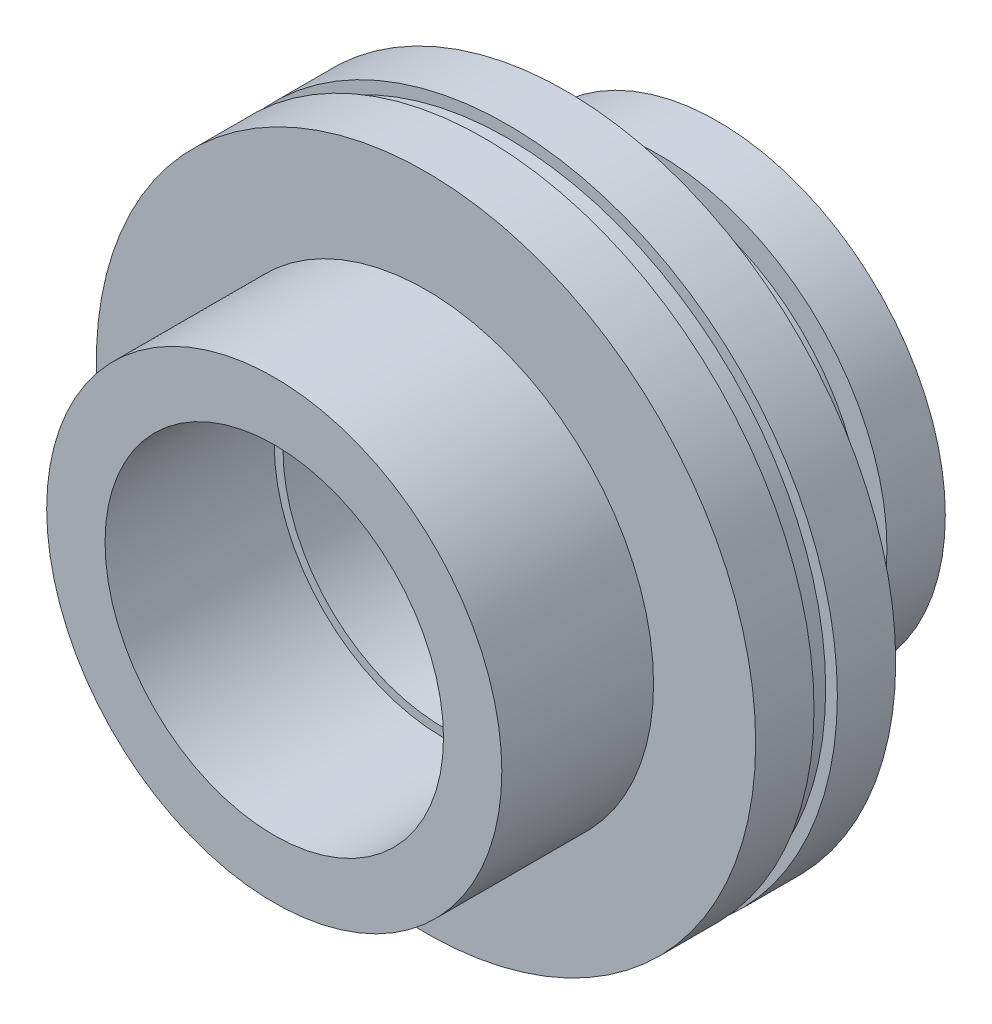
ISO-10303-21;
HEADER;
FILE_DESCRIPTION(('STEP AP214'),'2;1');
FILE_NAME('part.step','',(''),(''),'','','');
FILE_SCHEMA(('AUTOMOTIVE_DESIGN { 1 0 10303 214 1 1 1 1 }'));
ENDSEC;
DATA;
#1=APPLICATION_CONTEXT('core data for automotive mechanical design processes');
#2=APPLICATION_PROTOCOL_DEFINITION('international standard','automotive_design',2000,#1);
#3=PRODUCT_CONTEXT('',#1,'mechanical');
#4=PRODUCT('Part','Part','',(#3));
#5=PRODUCT_RELATED_PRODUCT_CATEGORY('part','',(#4));
#6=PRODUCT_DEFINITION_FORMATION('','',#4);
#7=PRODUCT_DEFINITION_CONTEXT('part definition',#1,'design');
#8=PRODUCT_DEFINITION('design','',#6,#7);
#9=PRODUCT_DEFINITION_SHAPE('','',#8);
#10=(LENGTH_UNIT() NAMED_UNIT(*) SI_UNIT(.MILLI.,.METRE.));
#11=(NAMED_UNIT(*) PLANE_ANGLE_UNIT() SI_UNIT($,.RADIAN.));
#12=(NAMED_UNIT(*) SI_UNIT($,.STERADIAN.) SOLID_ANGLE_UNIT());
#13=UNCERTAINTY_MEASURE_WITH_UNIT(LENGTH_MEASURE(1.E-05),#10,'distance_accuracy_value','');
#14=(GEOMETRIC_REPRESENTATION_CONTEXT(3) GLOBAL_UNCERTAINTY_ASSIGNED_CONTEXT((#13)) GLOBAL_UNIT_ASSIGNED_CONTEXT((#10,
#11,#12)) REPRESENTATION_CONTEXT('',''));
#15=CARTESIAN_POINT('',(0.,0.,0.));
#16=DIRECTION('',(0.,0.,1.));
#17=DIRECTION('',(1.,0.,0.));
#18=AXIS2_PLACEMENT_3D('',#15,#16,#17);
#19=CARTESIAN_POINT('',(0.,0.,-42.));
#20=DIRECTION('',(0.,0.,1.));
#21=DIRECTION('',(1.,0.,0.));
#22=AXIS2_PLACEMENT_3D('',#19,#20,#21);
#23=CYLINDRICAL_SURFACE('',#22,27.5);
#24=CARTESIAN_POINT('',(0.,0.,9.));
#25=DIRECTION('',(0.,0.,1.));
#26=DIRECTION('',(1.,0.,0.));
#27=AXIS2_PLACEMENT_3D('',#24,#25,#26);
#28=CIRCLE('',#27,27.5);
#29=CARTESIAN_POINT('',(27.5,0.,9.));
#30=VERTEX_POINT('',#29);
#31=EDGE_CURVE('E55',#30,#30,#28,.F.);
#32=ORIENTED_EDGE('',*,*,#31,.F.);
#33=EDGE_LOOP('',(#32));
#34=FACE_BOUND('',#33,.T.);
#35=CARTESIAN_POINT('',(0.,0.,-9.));
#36=DIRECTION('',(0.,0.,-1.));
#37=DIRECTION('',(-1.,0.,0.));
#38=AXIS2_PLACEMENT_3D('',#35,#36,#37);
#39=CIRCLE('',#38,27.5);
#40=CARTESIAN_POINT('',(-27.5,0.,-9.));
#41=VERTEX_POINT('',#40);
#42=EDGE_CURVE('E34',#41,#41,#39,.F.);
#43=ORIENTED_EDGE('',*,*,#42,.F.);
#44=EDGE_LOOP('',(#43));
#45=FACE_BOUND('',#44,.T.);
#46=ADVANCED_FACE('F30',(#34,#45),#23,.F.);
#47=CARTESIAN_POINT('',(0.,0.,38.));
#48=DIRECTION('',(0.,0.,1.));
#49=DIRECTION('',(-1.,0.,0.));
#50=AXIS2_PLACEMENT_3D('',#47,#48,#49);
#51=PLANE('',#50);
#52=CARTESIAN_POINT('',(0.,0.,38.));
#53=DIRECTION('',(0.,0.,-1.));
#54=DIRECTION('',(-1.,0.,0.));
#55=AXIS2_PLACEMENT_3D('',#52,#53,#54);
#56=CIRCLE('',#55,39.);
#57=CARTESIAN_POINT('',(-39.,0.,38.));
#58=VERTEX_POINT('',#57);
#59=EDGE_CURVE('E54',#58,#58,#56,.T.);
#60=ORIENTED_EDGE('',*,*,#59,.F.);
#61=EDGE_LOOP('',(#60));
#62=FACE_BOUND('',#61,.T.);
#63=CARTESIAN_POINT('',(0.,0.,38.));
#64=DIRECTION('',(0.,0.,1.));
#65=DIRECTION('',(1.,0.,0.));
#66=AXIS2_PLACEMENT_3D('',#63,#64,#65);
#67=CIRCLE('',#66,29.);
#68=CARTESIAN_POINT('',(29.,0.,38.));
#69=VERTEX_POINT('',#68);
#70=EDGE_CURVE('E58',#69,#69,#67,.F.);
#71=ORIENTED_EDGE('',*,*,#70,.T.);
#72=EDGE_LOOP('',(#71));
#73=FACE_BOUND('',#72,.T.);
#74=ADVANCED_FACE('F120',(#62,#73),#51,.T.);
#75=CARTESIAN_POINT('',(0.,0.,-38.));
#76=DIRECTION('',(0.,0.,1.));
#77=DIRECTION('',(1.,0.,0.));
#78=AXIS2_PLACEMENT_3D('',#75,#76,#77);
#79=CYLINDRICAL_SURFACE('',#78,39.);
#80=CARTESIAN_POINT('',(0.,0.,-12.));
#81=DIRECTION('',(0.,0.,1.));
#82=DIRECTION('',(1.,0.,0.));
#83=AXIS2_PLACEMENT_3D('',#80,#81,#82);
#84=CIRCLE('',#83,39.);
#85=CARTESIAN_POINT('',(39.,0.,-12.));
#86=VERTEX_POINT('',#85);
#87=EDGE_CURVE('E38',#86,#86,#84,.F.);
#88=ORIENTED_EDGE('',*,*,#87,.T.);
#89=EDGE_LOOP('',(#88));
#90=FACE_BOUND('',#89,.T.);
#91=CARTESIAN_POINT('',(0.,0.,-22.));
#92=DIRECTION('',(0.,0.,-1.));
#93=DIRECTION('',(-1.,0.,0.));
#94=AXIS2_PLACEMENT_3D('',#91,#92,#93);
#95=CIRCLE('',#94,39.);
#96=CARTESIAN_POINT('',(-39.,0.,-22.));
#97=VERTEX_POINT('',#96);
#98=EDGE_CURVE('E47',#97,#97,#95,.T.);
#99=ORIENTED_EDGE('',*,*,#98,.F.);
#100=EDGE_LOOP('',(#99));
#101=FACE_BOUND('',#100,.T.);
#102=ADVANCED_FACE('F126',(#90,#101),#79,.T.);
#103=CARTESIAN_POINT('',(0.,0.,-12.));
#104=DIRECTION('',(0.,0.,1.));
#105=DIRECTION('',(1.,0.,0.));
#106=AXIS2_PLACEMENT_3D('',#103,#104,#105);
#107=PLANE('',#106);
#108=CARTESIAN_POINT('',(0.,0.,-12.));
#109=DIRECTION('',(0.,0.,1.));
#110=DIRECTION('',(1.,0.,0.));
#111=AXIS2_PLACEMENT_3D('',#108,#109,#110);
#112=CIRCLE('',#111,56.5);
#113=CARTESIAN_POINT('',(56.5,0.,-12.));
#114=VERTEX_POINT('',#113);
#115=EDGE_CURVE('E43',#114,#114,#112,.T.);
#116=ORIENTED_EDGE('',*,*,#115,.F.);
#117=EDGE_LOOP('',(#116));
#118=FACE_BOUND('',#117,.T.);
#119=ORIENTED_EDGE('',*,*,#87,.F.);
#120=EDGE_LOOP('',(#119));
#121=FACE_BOUND('',#120,.T.);
#122=ADVANCED_FACE('F107',(#118,#121),#107,.F.);
#123=CARTESIAN_POINT('',(0.,0.,-12.));
#124=DIRECTION('',(0.,0.,1.));
#125=DIRECTION('',(1.,0.,0.));
#126=AXIS2_PLACEMENT_3D('',#123,#124,#125);
#127=CYLINDRICAL_SURFACE('',#126,56.5);
#128=CARTESIAN_POINT('',(0.,0.,2.));
#129=DIRECTION('',(0.,0.,1.));
#130=DIRECTION('',(1.,0.,0.));
#131=AXIS2_PLACEMENT_3D('',#128,#129,#130);
#132=CIRCLE('',#131,56.5);
#133=CARTESIAN_POINT('',(56.5,0.,2.));
#134=VERTEX_POINT('',#133);
#135=EDGE_CURVE('E94',#134,#134,#132,.F.);
#136=ORIENTED_EDGE('',*,*,#135,.F.);
#137=EDGE_LOOP('',(#136));
#138=FACE_BOUND('',#137,.T.);
#139=CARTESIAN_POINT('',(0.,0.,12.));
#140=DIRECTION('',(0.,0.,1.));
#141=DIRECTION('',(1.,0.,0.));
#142=AXIS2_PLACEMENT_3D('',#139,#140,#141);
#143=CIRCLE('',#142,56.5);
#144=CARTESIAN_POINT('',(56.5,0.,12.));
#145=VERTEX_POINT('',#144);
#146=EDGE_CURVE('E91',#145,#145,#143,.T.);
#147=ORIENTED_EDGE('',*,*,#146,.F.);
#148=EDGE_LOOP('',(#147));
#149=FACE_BOUND('',#148,.T.);
#150=ADVANCED_FACE('F32',(#138,#149),#127,.T.);
#151=CARTESIAN_POINT('',(0.,0.,12.));
#152=DIRECTION('',(0.,0.,1.));
#153=DIRECTION('',(1.,0.,0.));
#154=AXIS2_PLACEMENT_3D('',#151,#152,#153);
#155=PLANE('',#154);
#156=CARTESIAN_POINT('',(0.,0.,12.));
#157=DIRECTION('',(0.,0.,1.));
#158=DIRECTION('',(1.,0.,0.));
#159=AXIS2_PLACEMENT_3D('',#156,#157,#158);
#160=CIRCLE('',#159,39.);
#161=CARTESIAN_POINT('',(39.,0.,12.));
#162=VERTEX_POINT('',#161);
#163=EDGE_CURVE('E10',#162,#162,#160,.T.);
#164=ORIENTED_EDGE('',*,*,#163,.F.);
#165=EDGE_LOOP('',(#164));
#166=FACE_BOUND('',#165,.T.);
#167=ORIENTED_EDGE('',*,*,#146,.T.);
#168=EDGE_LOOP('',(#167));
#169=FACE_BOUND('',#168,.T.);
#170=ADVANCED_FACE('F106',(#166,#169),#155,.T.);
#171=CARTESIAN_POINT('',(0.,0.,2.));
#172=DIRECTION('',(0.,0.,1.));
#173=DIRECTION('',(1.,0.,0.));
#174=AXIS2_PLACEMENT_3D('',#171,#172,#173);
#175=PLANE('',#174);
#176=ORIENTED_EDGE('',*,*,#135,.T.);
#177=EDGE_LOOP('',(#176));
#178=FACE_BOUND('',#177,.T.);
#179=CARTESIAN_POINT('',(0.,0.,2.));
#180=DIRECTION('',(0.,0.,1.));
#181=DIRECTION('',(1.,0.,0.));
#182=AXIS2_PLACEMENT_3D('',#179,#180,#181);
#183=CIRCLE('',#182,54.5);
#184=CARTESIAN_POINT('',(54.5,0.,2.));
#185=VERTEX_POINT('',#184);
#186=EDGE_CURVE('E87',#185,#185,#183,.T.);
#187=ORIENTED_EDGE('',*,*,#186,.T.);
#188=EDGE_LOOP('',(#187));
#189=FACE_BOUND('',#188,.T.);
#190=ADVANCED_FACE('F101',(#178,#189),#175,.F.);
#191=CARTESIAN_POINT('',(0.,0.,2.));
#192=DIRECTION('',(0.,0.,-1.));
#193=DIRECTION('',(-1.,0.,0.));
#194=AXIS2_PLACEMENT_3D('',#191,#192,#193);
#195=CYLINDRICAL_SURFACE('',#194,54.5);
#196=ORIENTED_EDGE('',*,*,#186,.F.);
#197=EDGE_LOOP('',(#196));
#198=FACE_BOUND('',#197,.T.);
#199=CARTESIAN_POINT('',(0.,0.,-2.));
#200=DIRECTION('',(0.,0.,1.));
#201=DIRECTION('',(1.,0.,0.));
#202=AXIS2_PLACEMENT_3D('',#199,#200,#201);
#203=CIRCLE('',#202,54.5);
#204=CARTESIAN_POINT('',(54.5,0.,-2.));
#205=VERTEX_POINT('',#204);
#206=EDGE_CURVE('E84',#205,#205,#203,.T.);
#207=ORIENTED_EDGE('',*,*,#206,.T.);
#208=EDGE_LOOP('',(#207));
#209=FACE_BOUND('',#208,.T.);
#210=ADVANCED_FACE('F117',(#198,#209),#195,.T.);
#211=CARTESIAN_POINT('',(0.,0.,-2.));
#212=DIRECTION('',(0.,0.,1.));
#213=DIRECTION('',(1.,0.,0.));
#214=AXIS2_PLACEMENT_3D('',#211,#212,#213);
#215=PLANE('',#214);
#216=CARTESIAN_POINT('',(0.,0.,-2.));
#217=DIRECTION('',(0.,0.,1.));
#218=DIRECTION('',(1.,0.,0.));
#219=AXIS2_PLACEMENT_3D('',#216,#217,#218);
#220=CIRCLE('',#219,56.5);
#221=CARTESIAN_POINT('',(56.5,0.,-2.));
#222=VERTEX_POINT('',#221);
#223=EDGE_CURVE('E90',#222,#222,#220,.F.);
#224=ORIENTED_EDGE('',*,*,#223,.F.);
#225=EDGE_LOOP('',(#224));
#226=FACE_BOUND('',#225,.T.);
#227=ORIENTED_EDGE('',*,*,#206,.F.);
#228=EDGE_LOOP('',(#227));
#229=FACE_BOUND('',#228,.T.);
#230=ADVANCED_FACE('F160',(#226,#229),#215,.T.);
#231=ORIENTED_EDGE('',*,*,#115,.T.);
#232=EDGE_LOOP('',(#231));
#233=FACE_BOUND('',#232,.T.);
#234=ORIENTED_EDGE('',*,*,#223,.T.);
#235=EDGE_LOOP('',(#234));
#236=FACE_BOUND('',#235,.T.);
#237=ADVANCED_FACE('F108',(#233,#236),#127,.T.);
#238=CARTESIAN_POINT('',(0.,0.,38.));
#239=DIRECTION('',(0.,0.,-1.));
#240=DIRECTION('',(-1.,0.,0.));
#241=AXIS2_PLACEMENT_3D('',#238,#239,#240);
#242=CYLINDRICAL_SURFACE('',#241,39.);
#243=ORIENTED_EDGE('',*,*,#59,.T.);
#244=EDGE_LOOP('',(#243));
#245=FACE_BOUND('',#244,.T.);
#246=ORIENTED_EDGE('',*,*,#163,.T.);
#247=EDGE_LOOP('',(#246));
#248=FACE_BOUND('',#247,.T.);
#249=ADVANCED_FACE('F146',(#245,#248),#242,.T.);
#250=CARTESIAN_POINT('',(0.,0.,-28.));
#251=DIRECTION('',(0.,0.,-1.));
#252=DIRECTION('',(-1.,0.,0.));
#253=AXIS2_PLACEMENT_3D('',#250,#251,#252);
#254=PLANE('',#253);
#255=CARTESIAN_POINT('',(0.,0.,-28.));
#256=DIRECTION('',(0.,0.,-1.));
#257=DIRECTION('',(-1.,0.,0.));
#258=AXIS2_PLACEMENT_3D('',#255,#256,#257);
#259=CIRCLE('',#258,35.);
#260=CARTESIAN_POINT('',(-35.,0.,-28.));
#261=VERTEX_POINT('',#260);
#262=EDGE_CURVE('E51',#261,#261,#259,.T.);
#263=ORIENTED_EDGE('',*,*,#262,.T.);
#264=EDGE_LOOP('',(#263));
#265=FACE_BOUND('',#264,.T.);
#266=CARTESIAN_POINT('',(0.,0.,-28.));
#267=DIRECTION('',(0.,0.,-1.));
#268=DIRECTION('',(-1.,0.,0.));
#269=AXIS2_PLACEMENT_3D('',#266,#267,#268);
#270=CIRCLE('',#269,39.);
#271=CARTESIAN_POINT('',(-39.,0.,-28.));
#272=VERTEX_POINT('',#271);
#273=EDGE_CURVE('E50',#272,#272,#270,.T.);
#274=ORIENTED_EDGE('',*,*,#273,.F.);
#275=EDGE_LOOP('',(#274));
#276=FACE_BOUND('',#275,.T.);
#277=ADVANCED_FACE('F139',(#265,#276),#254,.F.);
#278=CARTESIAN_POINT('',(0.,0.,-22.));
#279=DIRECTION('',(0.,0.,-1.));
#280=DIRECTION('',(-1.,0.,0.));
#281=AXIS2_PLACEMENT_3D('',#278,#279,#280);
#282=PLANE('',#281);
#283=CARTESIAN_POINT('',(0.,0.,-22.));
#284=DIRECTION('',(0.,0.,-1.));
#285=DIRECTION('',(-1.,0.,0.));
#286=AXIS2_PLACEMENT_3D('',#283,#284,#285);
#287=CIRCLE('',#286,35.);
#288=CARTESIAN_POINT('',(-35.,0.,-22.));
#289=VERTEX_POINT('',#288);
#290=EDGE_CURVE('E61',#289,#289,#287,.T.);
#291=ORIENTED_EDGE('',*,*,#290,.F.);
#292=EDGE_LOOP('',(#291));
#293=FACE_BOUND('',#292,.T.);
#294=ORIENTED_EDGE('',*,*,#98,.T.);
#295=EDGE_LOOP('',(#294));
#296=FACE_BOUND('',#295,.T.);
#297=ADVANCED_FACE('F135',(#293,#296),#282,.T.);
#298=CARTESIAN_POINT('',(0.,0.,-28.));
#299=DIRECTION('',(0.,0.,1.));
#300=DIRECTION('',(1.,0.,0.));
#301=AXIS2_PLACEMENT_3D('',#298,#299,#300);
#302=CYLINDRICAL_SURFACE('',#301,35.);
#303=ORIENTED_EDGE('',*,*,#262,.F.);
#304=EDGE_LOOP('',(#303));
#305=FACE_BOUND('',#304,.T.);
#306=ORIENTED_EDGE('',*,*,#290,.T.);
#307=EDGE_LOOP('',(#306));
#308=FACE_BOUND('',#307,.T.);
#309=ADVANCED_FACE('F138',(#305,#308),#302,.T.);
#310=CARTESIAN_POINT('',(0.,0.,-38.));
#311=DIRECTION('',(0.,0.,-1.));
#312=DIRECTION('',(-1.,0.,0.));
#313=AXIS2_PLACEMENT_3D('',#310,#311,#312);
#314=PLANE('',#313);
#315=CARTESIAN_POINT('',(0.,0.,-38.));
#316=DIRECTION('',(0.,0.,-1.));
#317=DIRECTION('',(-1.,0.,0.));
#318=AXIS2_PLACEMENT_3D('',#315,#316,#317);
#319=CIRCLE('',#318,29.);
#320=CARTESIAN_POINT('',(-29.,0.,-38.));
#321=VERTEX_POINT('',#320);
#322=EDGE_CURVE('E62',#321,#321,#319,.T.);
#323=ORIENTED_EDGE('',*,*,#322,.F.);
#324=EDGE_LOOP('',(#323));
#325=FACE_BOUND('',#324,.T.);
#326=CARTESIAN_POINT('',(0.,0.,-38.));
#327=DIRECTION('',(0.,0.,-1.));
#328=DIRECTION('',(-1.,0.,0.));
#329=AXIS2_PLACEMENT_3D('',#326,#327,#328);
#330=CIRCLE('',#329,39.);
#331=CARTESIAN_POINT('',(-39.,0.,-38.));
#332=VERTEX_POINT('',#331);
#333=EDGE_CURVE('E81',#332,#332,#330,.T.);
#334=ORIENTED_EDGE('',*,*,#333,.T.);
#335=EDGE_LOOP('',(#334));
#336=FACE_BOUND('',#335,.T.);
#337=ADVANCED_FACE('F143',(#325,#336),#314,.T.);
#338=ORIENTED_EDGE('',*,*,#273,.T.);
#339=EDGE_LOOP('',(#338));
#340=FACE_BOUND('',#339,.T.);
#341=ORIENTED_EDGE('',*,*,#333,.F.);
#342=EDGE_LOOP('',(#341));
#343=FACE_BOUND('',#342,.T.);
#344=ADVANCED_FACE('F154',(#340,#343),#79,.T.);
#345=CARTESIAN_POINT('',(0.,0.,9.));
#346=DIRECTION('',(0.,0.,1.));
#347=DIRECTION('',(1.,0.,0.));
#348=AXIS2_PLACEMENT_3D('',#345,#346,#347);
#349=PLANE('',#348);
#350=CARTESIAN_POINT('',(0.,0.,9.));
#351=DIRECTION('',(0.,0.,1.));
#352=DIRECTION('',(1.,0.,0.));
#353=AXIS2_PLACEMENT_3D('',#350,#351,#352);
#354=CIRCLE('',#353,29.);
#355=CARTESIAN_POINT('',(29.,0.,9.));
#356=VERTEX_POINT('',#355);
#357=EDGE_CURVE('E59',#356,#356,#354,.T.);
#358=ORIENTED_EDGE('',*,*,#357,.T.);
#359=EDGE_LOOP('',(#358));
#360=FACE_BOUND('',#359,.T.);
#361=ORIENTED_EDGE('',*,*,#31,.T.);
#362=EDGE_LOOP('',(#361));
#363=FACE_BOUND('',#362,.T.);
#364=ADVANCED_FACE('F158',(#360,#363),#349,.T.);
#365=CARTESIAN_POINT('',(0.,0.,59.));
#366=DIRECTION('',(0.,0.,-1.));
#367=DIRECTION('',(-1.,0.,0.));
#368=AXIS2_PLACEMENT_3D('',#365,#366,#367);
#369=CYLINDRICAL_SURFACE('',#368,29.);
#370=ORIENTED_EDGE('',*,*,#70,.F.);
#371=EDGE_LOOP('',(#370));
#372=FACE_BOUND('',#371,.T.);
#373=ORIENTED_EDGE('',*,*,#357,.F.);
#374=EDGE_LOOP('',(#373));
#375=FACE_BOUND('',#374,.T.);
#376=ADVANCED_FACE('F133',(#372,#375),#369,.F.);
#377=CARTESIAN_POINT('',(0.,0.,-9.));
#378=DIRECTION('',(0.,0.,-1.));
#379=DIRECTION('',(1.,0.,0.));
#380=AXIS2_PLACEMENT_3D('',#377,#378,#379);
#381=PLANE('',#380);
#382=CARTESIAN_POINT('',(0.,0.,-9.));
#383=DIRECTION('',(0.,0.,1.));
#384=DIRECTION('',(1.,0.,0.));
#385=AXIS2_PLACEMENT_3D('',#382,#383,#384);
#386=CIRCLE('',#385,29.);
#387=CARTESIAN_POINT('',(29.,0.,-9.));
#388=VERTEX_POINT('',#387);
#389=EDGE_CURVE('E64',#388,#388,#386,.T.);
#390=ORIENTED_EDGE('',*,*,#389,.F.);
#391=EDGE_LOOP('',(#390));
#392=FACE_BOUND('',#391,.T.);
#393=ORIENTED_EDGE('',*,*,#42,.T.);
#394=EDGE_LOOP('',(#393));
#395=FACE_BOUND('',#394,.T.);
#396=ADVANCED_FACE('F224',(#392,#395),#381,.T.);
#397=CARTESIAN_POINT('',(0.,0.,-59.));
#398=DIRECTION('',(0.,0.,1.));
#399=DIRECTION('',(1.,0.,0.));
#400=AXIS2_PLACEMENT_3D('',#397,#398,#399);
#401=CYLINDRICAL_SURFACE('',#400,29.);
#402=ORIENTED_EDGE('',*,*,#322,.T.);
#403=EDGE_LOOP('',(#402));
#404=FACE_BOUND('',#403,.T.);
#405=ORIENTED_EDGE('',*,*,#389,.T.);
#406=EDGE_LOOP('',(#405));
#407=FACE_BOUND('',#406,.T.);
#408=ADVANCED_FACE('F230',(#404,#407),#401,.F.);
#409=CLOSED_SHELL('',(#46,#74,#102,#122,#150,#170,#190,#210,#230,#237,#249,#277,#297,#309,#337,
#344,#364,#376,#396,#408));
#410=MANIFOLD_SOLID_BREP('B2',#409);
#411=ADVANCED_BREP_SHAPE_REPRESENTATION('',(#18,#410),#14);
#412=SHAPE_DEFINITION_REPRESENTATION(#9,#411);
ENDSEC;
END-ISO-10303-21;
